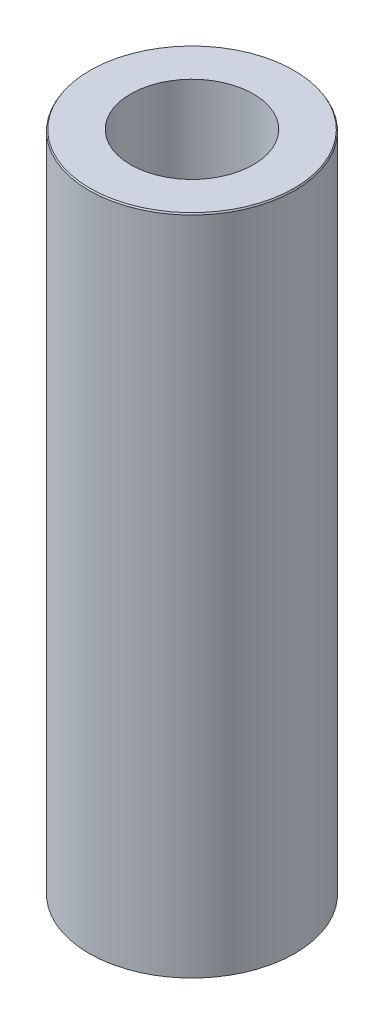
ISO-10303-21;
HEADER;
FILE_DESCRIPTION(('STEP AP214'),'2;1');
FILE_NAME('part.step','',(''),(''),'','','');
FILE_SCHEMA(('AUTOMOTIVE_DESIGN { 1 0 10303 214 1 1 1 1 }'));
ENDSEC;
DATA;
#1=APPLICATION_CONTEXT('core data for automotive mechanical design processes');
#2=APPLICATION_PROTOCOL_DEFINITION('international standard','automotive_design',2000,#1);
#3=PRODUCT_CONTEXT('',#1,'mechanical');
#4=PRODUCT('Part','Part','',(#3));
#5=PRODUCT_RELATED_PRODUCT_CATEGORY('part','',(#4));
#6=PRODUCT_DEFINITION_FORMATION('','',#4);
#7=PRODUCT_DEFINITION_CONTEXT('part definition',#1,'design');
#8=PRODUCT_DEFINITION('design','',#6,#7);
#9=PRODUCT_DEFINITION_SHAPE('','',#8);
#10=(LENGTH_UNIT() NAMED_UNIT(*) SI_UNIT(.MILLI.,.METRE.));
#11=(NAMED_UNIT(*) PLANE_ANGLE_UNIT() SI_UNIT($,.RADIAN.));
#12=(NAMED_UNIT(*) SI_UNIT($,.STERADIAN.) SOLID_ANGLE_UNIT());
#13=UNCERTAINTY_MEASURE_WITH_UNIT(LENGTH_MEASURE(1.E-05),#10,'distance_accuracy_value','');
#14=(GEOMETRIC_REPRESENTATION_CONTEXT(3) GLOBAL_UNCERTAINTY_ASSIGNED_CONTEXT((#13)) GLOBAL_UNIT_ASSIGNED_CONTEXT((#10,
#11,#12)) REPRESENTATION_CONTEXT('',''));
#15=CARTESIAN_POINT('',(0.,0.,0.));
#16=DIRECTION('',(0.,0.,1.));
#17=DIRECTION('',(1.,0.,0.));
#18=AXIS2_PLACEMENT_3D('',#15,#16,#17);
#19=CARTESIAN_POINT('',(0.,306.037137291398,0.));
#20=DIRECTION('',(0.,-1.,0.));
#21=DIRECTION('',(0.,0.,-1.));
#22=AXIS2_PLACEMENT_3D('',#19,#20,#21);
#23=CYLINDRICAL_SURFACE('',#22,47.5);
#24=CARTESIAN_POINT('',(0.,305.352274263486,0.));
#25=DIRECTION('',(0.,1.,0.));
#26=DIRECTION('',(0.,0.,1.));
#27=AXIS2_PLACEMENT_3D('',#24,#25,#26);
#28=CIRCLE('',#27,47.5);
#29=CARTESIAN_POINT('',(0.,305.352274263486,47.5));
#30=VERTEX_POINT('',#29);
#31=EDGE_CURVE('E50',#30,#30,#28,.F.);
#32=ORIENTED_EDGE('',*,*,#31,.T.);
#33=EDGE_LOOP('',(#32));
#34=FACE_BOUND('',#33,.T.);
#35=CARTESIAN_POINT('',(0.,0.395405853522657,0.));
#36=DIRECTION('',(0.,1.,0.));
#37=DIRECTION('',(0.,0.,1.));
#38=AXIS2_PLACEMENT_3D('',#35,#36,#37);
#39=CIRCLE('',#38,47.5);
#40=CARTESIAN_POINT('',(0.,0.395405853522657,47.5));
#41=VERTEX_POINT('',#40);
#42=EDGE_CURVE('E51',#41,#41,#39,.T.);
#43=ORIENTED_EDGE('',*,*,#42,.T.);
#44=EDGE_LOOP('',(#43));
#45=FACE_BOUND('',#44,.T.);
#46=ADVANCED_FACE('F39',(#34,#45),#23,.T.);
#47=CARTESIAN_POINT('',(0.,306.037137291398,0.));
#48=DIRECTION('',(0.,1.,0.));
#49=DIRECTION('',(0.,0.,1.));
#50=AXIS2_PLACEMENT_3D('',#47,#48,#49);
#51=PLANE('',#50);
#52=CARTESIAN_POINT('',(0.,306.037137291398,0.));
#53=DIRECTION('',(0.,1.,0.));
#54=DIRECTION('',(0.,0.,1.));
#55=AXIS2_PLACEMENT_3D('',#52,#53,#54);
#56=CIRCLE('',#55,47.1045941464774);
#57=CARTESIAN_POINT('',(0.,306.037137291398,47.1045941464774));
#58=VERTEX_POINT('',#57);
#59=EDGE_CURVE('E54',#58,#58,#56,.T.);
#60=ORIENTED_EDGE('',*,*,#59,.T.);
#61=EDGE_LOOP('',(#60));
#62=FACE_BOUND('',#61,.T.);
#63=CARTESIAN_POINT('',(0.,306.037137291398,0.));
#64=DIRECTION('',(0.,1.,0.));
#65=DIRECTION('',(0.,0.,1.));
#66=AXIS2_PLACEMENT_3D('',#63,#64,#65);
#67=CIRCLE('',#66,28.3279912771142);
#68=CARTESIAN_POINT('',(0.,306.037137291398,28.3279912771142));
#69=VERTEX_POINT('',#68);
#70=EDGE_CURVE('E58',#69,#69,#67,.T.);
#71=ORIENTED_EDGE('',*,*,#70,.F.);
#72=EDGE_LOOP('',(#71));
#73=FACE_BOUND('',#72,.T.);
#74=ADVANCED_FACE('F69',(#62,#73),#51,.T.);
#75=CARTESIAN_POINT('',(0.,0.,0.));
#76=DIRECTION('',(0.,1.,0.));
#77=DIRECTION('',(0.,0.,1.));
#78=AXIS2_PLACEMENT_3D('',#75,#76,#77);
#79=PLANE('',#78);
#80=CARTESIAN_POINT('',(0.,0.,0.));
#81=DIRECTION('',(0.,1.,0.));
#82=DIRECTION('',(0.,0.,1.));
#83=AXIS2_PLACEMENT_3D('',#80,#81,#82);
#84=CIRCLE('',#83,46.8151369720886);
#85=CARTESIAN_POINT('',(0.,0.,46.8151369720886));
#86=VERTEX_POINT('',#85);
#87=EDGE_CURVE('E10',#86,#86,#84,.F.);
#88=ORIENTED_EDGE('',*,*,#87,.T.);
#89=EDGE_LOOP('',(#88));
#90=FACE_BOUND('',#89,.T.);
#91=CARTESIAN_POINT('',(0.,0.,0.));
#92=DIRECTION('',(0.,1.,0.));
#93=DIRECTION('',(0.,0.,1.));
#94=AXIS2_PLACEMENT_3D('',#91,#92,#93);
#95=CIRCLE('',#94,28.3279912771142);
#96=CARTESIAN_POINT('',(0.,0.,28.3279912771142));
#97=VERTEX_POINT('',#96);
#98=EDGE_CURVE('E63',#97,#97,#95,.T.);
#99=ORIENTED_EDGE('',*,*,#98,.T.);
#100=EDGE_LOOP('',(#99));
#101=FACE_BOUND('',#100,.T.);
#102=ADVANCED_FACE('F75',(#90,#101),#79,.F.);
#103=CARTESIAN_POINT('',(0.,306.037137291398,0.));
#104=DIRECTION('',(0.,-1.,0.));
#105=DIRECTION('',(0.,0.,-1.));
#106=AXIS2_PLACEMENT_3D('',#103,#104,#105);
#107=CYLINDRICAL_SURFACE('',#106,28.3279912771142);
#108=ORIENTED_EDGE('',*,*,#70,.T.);
#109=EDGE_LOOP('',(#108));
#110=FACE_BOUND('',#109,.T.);
#111=ORIENTED_EDGE('',*,*,#98,.F.);
#112=EDGE_LOOP('',(#111));
#113=FACE_BOUND('',#112,.T.);
#114=ADVANCED_FACE('F70',(#110,#113),#107,.F.);
#115=CARTESIAN_POINT('',(0.,306.037137291398,0.));
#116=DIRECTION('',(0.,-1.,0.));
#117=DIRECTION('',(0.,0.,-1.));
#118=AXIS2_PLACEMENT_3D('',#115,#116,#117);
#119=CONICAL_SURFACE('',#118,47.1045941464774,0.523598775598273);
#120=ORIENTED_EDGE('',*,*,#31,.F.);
#121=EDGE_LOOP('',(#120));
#122=FACE_BOUND('',#121,.T.);
#123=ORIENTED_EDGE('',*,*,#59,.F.);
#124=EDGE_LOOP('',(#123));
#125=FACE_BOUND('',#124,.T.);
#126=ADVANCED_FACE('F81',(#122,#125),#119,.T.);
#127=CARTESIAN_POINT('',(0.,0.395405853522657,0.));
#128=DIRECTION('',(0.,1.,0.));
#129=DIRECTION('',(0.,0.,1.));
#130=AXIS2_PLACEMENT_3D('',#127,#128,#129);
#131=CONICAL_SURFACE('',#130,47.5,1.04719755119659);
#132=CARTESIAN_POINT('',(0.,0.,46.8151369720886));
#133=CARTESIAN_POINT('',(0.,0.00411881097419594,46.8222709619627));
#134=CARTESIAN_POINT('',(0.,0.00823762194838971,46.8294049518368));
#135=CARTESIAN_POINT('',(0.,0.0164752438967772,46.8436729315849));
#136=CARTESIAN_POINT('',(0.,0.020594054870971,46.850806921459));
#137=CARTESIAN_POINT('',(0.,0.02883167681936,46.8650749012072));
#138=CARTESIAN_POINT('',(0.,0.0329504877935552,46.8722088910813));
#139=CARTESIAN_POINT('',(0.,0.0411881097419438,46.8864768708294));
#140=CARTESIAN_POINT('',(0.,0.0453069207161372,46.8936108607035));
#141=CARTESIAN_POINT('',(0.,0.0535445426645259,46.9078788404516));
#142=CARTESIAN_POINT('',(0.,0.0576633536387212,46.9150128303257));
#143=CARTESIAN_POINT('',(0.,0.0659009755871099,46.9292808100739));
#144=CARTESIAN_POINT('',(0.,0.0700197865613033,46.9364147999479));
#145=CARTESIAN_POINT('',(0.,0.0782574085096919,46.9506827796961));
#146=CARTESIAN_POINT('',(0.,0.0823762194838873,46.9578167695702));
#147=CARTESIAN_POINT('',(0.,0.090613841432276,46.9720847493183));
#148=CARTESIAN_POINT('',(0.,0.0947326524064693,46.9792187391924));
#149=CARTESIAN_POINT('',(0.,0.102970274354858,46.9934867189406));
#150=CARTESIAN_POINT('',(0.,0.107089085329053,47.0006207088146));
#151=CARTESIAN_POINT('',(0.,0.115326707277442,47.0148886885628));
#152=CARTESIAN_POINT('',(0.,0.119445518251635,47.0220226784369));
#153=CARTESIAN_POINT('',(0.,0.127683140200024,47.036290658185));
#154=CARTESIAN_POINT('',(0.,0.131801951174219,47.0434246480591));
#155=CARTESIAN_POINT('',(0.,0.140039573122608,47.0576926278072));
#156=CARTESIAN_POINT('',(0.,0.144158384096801,47.0648266176813));
#157=CARTESIAN_POINT('',(0.,0.15239600604519,47.0790945974295));
#158=CARTESIAN_POINT('',(0.,0.156514817019385,47.0862285873036));
#159=CARTESIAN_POINT('',(0.,0.164752438967774,47.1004965670517));
#160=CARTESIAN_POINT('',(0.,0.168871249941968,47.1076305569258));
#161=CARTESIAN_POINT('',(0.,0.177108871890356,47.1218985366739));
#162=CARTESIAN_POINT('',(0.,0.181227682864551,47.129032526548));
#163=CARTESIAN_POINT('',(0.,0.18946530481294,47.1433005062962));
#164=CARTESIAN_POINT('',(0.,0.193584115787135,47.1504344961702));
#165=CARTESIAN_POINT('',(0.,0.201821737735523,47.1647024759184));
#166=CARTESIAN_POINT('',(0.,0.205940548709716,47.1718364657925));
#167=CARTESIAN_POINT('',(0.,0.214178170658105,47.1861044455406));
#168=CARTESIAN_POINT('',(0.,0.218296981632301,47.1932384354147));
#169=CARTESIAN_POINT('',(0.,0.226534603580689,47.2075064151629));
#170=CARTESIAN_POINT('',(0.,0.230653414554883,47.2146404050369));
#171=CARTESIAN_POINT('',(0.,0.238891036503271,47.2289083847851));
#172=CARTESIAN_POINT('',(0.,0.243009847477467,47.2360423746592));
#173=CARTESIAN_POINT('',(0.,0.251247469425855,47.2503103544073));
#174=CARTESIAN_POINT('',(0.,0.255366280400049,47.2574443442814));
#175=CARTESIAN_POINT('',(0.,0.263603902348437,47.2717123240296));
#176=CARTESIAN_POINT('',(0.,0.267722713322633,47.2788463139036));
#177=CARTESIAN_POINT('',(0.,0.275960335271021,47.2931142936518));
#178=CARTESIAN_POINT('',(0.,0.280079146245215,47.3002482835259));
#179=CARTESIAN_POINT('',(0.,0.288316768193603,47.314516263274));
#180=CARTESIAN_POINT('',(0.,0.292435579167799,47.3216502531481));
#181=CARTESIAN_POINT('',(0.,0.300673201116187,47.3359182328962));
#182=CARTESIAN_POINT('',(0.,0.304792012090381,47.3430522227703));
#183=CARTESIAN_POINT('',(0.,0.313029634038769,47.3573202025185));
#184=CARTESIAN_POINT('',(0.,0.317148445012965,47.3644541923925));
#185=CARTESIAN_POINT('',(0.,0.325386066961353,47.3787221721407));
#186=CARTESIAN_POINT('',(0.,0.329504877935547,47.3858561620148));
#187=CARTESIAN_POINT('',(0.,0.337742499883935,47.4001241417629));
#188=CARTESIAN_POINT('',(0.,0.341861310858131,47.407258131637));
#189=CARTESIAN_POINT('',(0.,0.350098932806519,47.4215261113852));
#190=CARTESIAN_POINT('',(0.,0.354217743780713,47.4286601012592));
#191=CARTESIAN_POINT('',(0.,0.362455365729101,47.4429280810074));
#192=CARTESIAN_POINT('',(0.,0.366574176703297,47.4500620708815));
#193=CARTESIAN_POINT('',(0.,0.374811798651686,47.4643300506296));
#194=CARTESIAN_POINT('',(0.,0.378930609625879,47.4714640405037));
#195=CARTESIAN_POINT('',(0.,0.387168231574267,47.4857320202519));
#196=CARTESIAN_POINT('',(0.,0.391287042548461,47.4928660101259));
#197=CARTESIAN_POINT('',(0.,0.395405853522657,47.5));
#198=B_SPLINE_CURVE_WITH_KNOTS('',3,(#132,#133,#134,#135,#136,#137,#138,#139,#140,#141,#142,
#143,#144,#145,#146,#147,#148,#149,#150,#151,#152,#153,#154,#155,#156,#157,#158,#159,#160,#161,
#162,#163,#164,#165,#166,#167,#168,#169,#170,#171,#172,#173,#174,#175,#176,#177,#178,#179,#180,
#181,#182,#183,#184,#185,#186,#187,#188,#189,#190,#191,#192,#193,#194,#195,#196,#197),
.UNSPECIFIED.,.F.,.F.,(4,2,2,2,2,2,2,2,2,2,2,2,2,2,2,2,2,2,2,2,2,2,2,2,2,2,2,2,2,2,2,2,4),(0.,
0.024712865845163,0.0494257316903319,0.0741385975354949,0.0988514633806638,0.123564329225827,
0.148277195070996,0.172990060916159,0.197702926761328,0.222415792606491,0.24712865845166,
0.271841524296823,0.296554390141991,0.321267255987154,0.345980121832323,0.370692987677486,
0.395405853522649,0.420118719367818,0.444831585212981,0.46954445105815,0.494257316903313,
0.518970182748482,0.543683048593645,0.568395914438814,0.593108780283977,0.617821646129146,
0.642534511974309,0.667247377819478,0.691960243664641,0.71667310950981,0.741385975354973,
0.766098841200142,0.790811707045305),.UNSPECIFIED.);
#199=EDGE_CURVE('BSEAM45',#86,#41,#198,.T.);
#200=ORIENTED_EDGE('',*,*,#87,.F.);
#201=ORIENTED_EDGE('',*,*,#42,.F.);
#202=ORIENTED_EDGE('',*,*,#199,.T.);
#203=ORIENTED_EDGE('',*,*,#199,.F.);
#204=EDGE_LOOP('',(#200,#202,#201,#203));
#205=FACE_BOUND('',#204,.T.);
#206=ADVANCED_FACE('F45',(#205),#131,.T.);
#207=CLOSED_SHELL('',(#46,#74,#102,#114,#126,#206));
#208=MANIFOLD_SOLID_BREP('B2',#207);
#209=ADVANCED_BREP_SHAPE_REPRESENTATION('',(#18,#208),#14);
#210=SHAPE_DEFINITION_REPRESENTATION(#9,#209);
ENDSEC;
END-ISO-10303-21;
